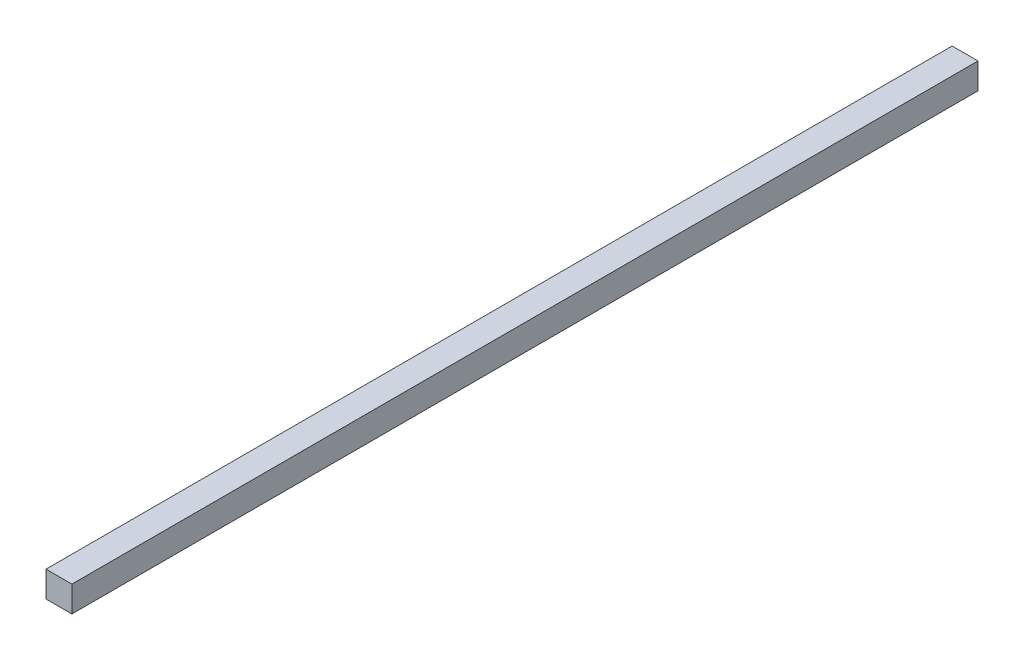
ISO-10303-21;
HEADER;
FILE_DESCRIPTION(('STEP AP214'),'2;1');
FILE_NAME('part.step','',(''),(''),'','','');
FILE_SCHEMA(('AUTOMOTIVE_DESIGN { 1 0 10303 214 1 1 1 1 }'));
ENDSEC;
DATA;
#1=APPLICATION_CONTEXT('core data for automotive mechanical design processes');
#2=APPLICATION_PROTOCOL_DEFINITION('international standard','automotive_design',2000,#1);
#3=PRODUCT_CONTEXT('',#1,'mechanical');
#4=PRODUCT('Part','Part','',(#3));
#5=PRODUCT_RELATED_PRODUCT_CATEGORY('part','',(#4));
#6=PRODUCT_DEFINITION_FORMATION('','',#4);
#7=PRODUCT_DEFINITION_CONTEXT('part definition',#1,'design');
#8=PRODUCT_DEFINITION('design','',#6,#7);
#9=PRODUCT_DEFINITION_SHAPE('','',#8);
#10=(LENGTH_UNIT() NAMED_UNIT(*) SI_UNIT(.MILLI.,.METRE.));
#11=(NAMED_UNIT(*) PLANE_ANGLE_UNIT() SI_UNIT($,.RADIAN.));
#12=(NAMED_UNIT(*) SI_UNIT($,.STERADIAN.) SOLID_ANGLE_UNIT());
#13=UNCERTAINTY_MEASURE_WITH_UNIT(LENGTH_MEASURE(1.E-05),#10,'distance_accuracy_value','');
#14=(GEOMETRIC_REPRESENTATION_CONTEXT(3) GLOBAL_UNCERTAINTY_ASSIGNED_CONTEXT((#13)) GLOBAL_UNIT_ASSIGNED_CONTEXT((#10,
#11,#12)) REPRESENTATION_CONTEXT('',''));
#15=CARTESIAN_POINT('',(0.,0.,0.));
#16=DIRECTION('',(0.,0.,1.));
#17=DIRECTION('',(1.,0.,0.));
#18=AXIS2_PLACEMENT_3D('',#15,#16,#17);
#19=CARTESIAN_POINT('',(5.,-5.,350.));
#20=DIRECTION('',(-1.,0.,0.));
#21=DIRECTION('',(0.,0.,1.));
#22=AXIS2_PLACEMENT_3D('',#19,#20,#21);
#23=PLANE('',#22);
#24=DIRECTION('',(0.,1.,0.));
#25=VECTOR('',#24,1.);
#26=CARTESIAN_POINT('',(5.,-5.,0.));
#27=LINE('',#26,#25);
#28=CARTESIAN_POINT('',(5.,-5.,0.));
#29=VERTEX_POINT('',#28);
#30=CARTESIAN_POINT('',(5.,5.,0.));
#31=VERTEX_POINT('',#30);
#32=EDGE_CURVE('E96',#29,#31,#27,.T.);
#33=ORIENTED_EDGE('',*,*,#32,.T.);
#34=DIRECTION('',(0.,0.,-1.));
#35=VECTOR('',#34,1.);
#36=CARTESIAN_POINT('',(5.,5.,350.));
#37=LINE('',#36,#35);
#38=CARTESIAN_POINT('',(5.,5.,350.));
#39=VERTEX_POINT('',#38);
#40=EDGE_CURVE('E11',#39,#31,#37,.T.);
#41=ORIENTED_EDGE('',*,*,#40,.F.);
#42=DIRECTION('',(0.,1.,0.));
#43=VECTOR('',#42,1.);
#44=CARTESIAN_POINT('',(5.,-5.,350.));
#45=LINE('',#44,#43);
#46=CARTESIAN_POINT('',(5.,-5.,350.));
#47=VERTEX_POINT('',#46);
#48=EDGE_CURVE('E84',#47,#39,#45,.T.);
#49=ORIENTED_EDGE('',*,*,#48,.F.);
#50=DIRECTION('',(0.,0.,-1.));
#51=VECTOR('',#50,1.);
#52=CARTESIAN_POINT('',(5.,-5.,350.));
#53=LINE('',#52,#51);
#54=EDGE_CURVE('E92',#47,#29,#53,.T.);
#55=ORIENTED_EDGE('',*,*,#54,.T.);
#56=EDGE_LOOP('',(#33,#41,#49,#55));
#57=FACE_BOUND('',#56,.T.);
#58=ADVANCED_FACE('F33',(#57),#23,.F.);
#59=CARTESIAN_POINT('',(-5.,5.,350.));
#60=DIRECTION('',(0.,-1.,0.));
#61=DIRECTION('',(0.,0.,-1.));
#62=AXIS2_PLACEMENT_3D('',#59,#60,#61);
#63=PLANE('',#62);
#64=DIRECTION('',(-1.,0.,0.));
#65=VECTOR('',#64,1.);
#66=CARTESIAN_POINT('',(-5.,5.,0.));
#67=LINE('',#66,#65);
#68=CARTESIAN_POINT('',(-5.,5.,0.));
#69=VERTEX_POINT('',#68);
#70=EDGE_CURVE('E88',#31,#69,#67,.T.);
#71=ORIENTED_EDGE('',*,*,#70,.T.);
#72=DIRECTION('',(0.,0.,-1.));
#73=VECTOR('',#72,1.);
#74=CARTESIAN_POINT('',(-5.,5.,350.));
#75=LINE('',#74,#73);
#76=CARTESIAN_POINT('',(-5.,5.,350.));
#77=VERTEX_POINT('',#76);
#78=EDGE_CURVE('E41',#77,#69,#75,.T.);
#79=ORIENTED_EDGE('',*,*,#78,.F.);
#80=DIRECTION('',(-1.,0.,0.));
#81=VECTOR('',#80,1.);
#82=CARTESIAN_POINT('',(-5.,5.,350.));
#83=LINE('',#82,#81);
#84=EDGE_CURVE('E79',#39,#77,#83,.T.);
#85=ORIENTED_EDGE('',*,*,#84,.F.);
#86=ORIENTED_EDGE('',*,*,#40,.T.);
#87=EDGE_LOOP('',(#71,#79,#85,#86));
#88=FACE_BOUND('',#87,.T.);
#89=ADVANCED_FACE('F87',(#88),#63,.F.);
#90=CARTESIAN_POINT('',(-5.,-5.,350.));
#91=DIRECTION('',(1.,0.,0.));
#92=DIRECTION('',(0.,0.,-1.));
#93=AXIS2_PLACEMENT_3D('',#90,#91,#92);
#94=PLANE('',#93);
#95=DIRECTION('',(0.,-1.,0.));
#96=VECTOR('',#95,1.);
#97=CARTESIAN_POINT('',(-5.,-5.,0.));
#98=LINE('',#97,#96);
#99=CARTESIAN_POINT('',(-5.,-5.,0.));
#100=VERTEX_POINT('',#99);
#101=EDGE_CURVE('E66',#69,#100,#98,.T.);
#102=ORIENTED_EDGE('',*,*,#101,.T.);
#103=DIRECTION('',(0.,0.,-1.));
#104=VECTOR('',#103,1.);
#105=CARTESIAN_POINT('',(-5.,-5.,350.));
#106=LINE('',#105,#104);
#107=CARTESIAN_POINT('',(-5.,-5.,350.));
#108=VERTEX_POINT('',#107);
#109=EDGE_CURVE('E89',#108,#100,#106,.T.);
#110=ORIENTED_EDGE('',*,*,#109,.F.);
#111=DIRECTION('',(0.,-1.,0.));
#112=VECTOR('',#111,1.);
#113=CARTESIAN_POINT('',(-5.,-5.,350.));
#114=LINE('',#113,#112);
#115=EDGE_CURVE('E82',#77,#108,#114,.T.);
#116=ORIENTED_EDGE('',*,*,#115,.F.);
#117=ORIENTED_EDGE('',*,*,#78,.T.);
#118=EDGE_LOOP('',(#102,#110,#116,#117));
#119=FACE_BOUND('',#118,.T.);
#120=ADVANCED_FACE('F90',(#119),#94,.F.);
#121=CARTESIAN_POINT('',(-5.,-5.,350.));
#122=DIRECTION('',(0.,1.,0.));
#123=DIRECTION('',(0.,0.,1.));
#124=AXIS2_PLACEMENT_3D('',#121,#122,#123);
#125=PLANE('',#124);
#126=DIRECTION('',(1.,0.,0.));
#127=VECTOR('',#126,1.);
#128=CARTESIAN_POINT('',(-5.,-5.,0.));
#129=LINE('',#128,#127);
#130=EDGE_CURVE('E72',#100,#29,#129,.T.);
#131=ORIENTED_EDGE('',*,*,#130,.T.);
#132=ORIENTED_EDGE('',*,*,#54,.F.);
#133=DIRECTION('',(1.,0.,0.));
#134=VECTOR('',#133,1.);
#135=CARTESIAN_POINT('',(-5.,-5.,350.));
#136=LINE('',#135,#134);
#137=EDGE_CURVE('E49',#108,#47,#136,.T.);
#138=ORIENTED_EDGE('',*,*,#137,.F.);
#139=ORIENTED_EDGE('',*,*,#109,.T.);
#140=EDGE_LOOP('',(#131,#132,#138,#139));
#141=FACE_BOUND('',#140,.T.);
#142=ADVANCED_FACE('F103',(#141),#125,.F.);
#143=CARTESIAN_POINT('',(0.,0.,350.));
#144=DIRECTION('',(0.,0.,-1.));
#145=DIRECTION('',(-1.,0.,0.));
#146=AXIS2_PLACEMENT_3D('',#143,#144,#145);
#147=PLANE('',#146);
#148=ORIENTED_EDGE('',*,*,#48,.T.);
#149=ORIENTED_EDGE('',*,*,#84,.T.);
#150=ORIENTED_EDGE('',*,*,#115,.T.);
#151=ORIENTED_EDGE('',*,*,#137,.T.);
#152=EDGE_LOOP('',(#148,#149,#150,#151));
#153=FACE_BOUND('',#152,.T.);
#154=ADVANCED_FACE('F80',(#153),#147,.F.);
#155=CARTESIAN_POINT('',(0.,0.,0.));
#156=DIRECTION('',(0.,0.,-1.));
#157=DIRECTION('',(-1.,0.,0.));
#158=AXIS2_PLACEMENT_3D('',#155,#156,#157);
#159=PLANE('',#158);
#160=ORIENTED_EDGE('',*,*,#32,.F.);
#161=ORIENTED_EDGE('',*,*,#130,.F.);
#162=ORIENTED_EDGE('',*,*,#101,.F.);
#163=ORIENTED_EDGE('',*,*,#70,.F.);
#164=EDGE_LOOP('',(#160,#161,#162,#163));
#165=FACE_BOUND('',#164,.T.);
#166=ADVANCED_FACE('F106',(#165),#159,.T.);
#167=CLOSED_SHELL('',(#58,#89,#120,#142,#154,#166));
#168=MANIFOLD_SOLID_BREP('B2',#167);
#169=ADVANCED_BREP_SHAPE_REPRESENTATION('',(#18,#168),#14);
#170=SHAPE_DEFINITION_REPRESENTATION(#9,#169);
ENDSEC;
END-ISO-10303-21;
